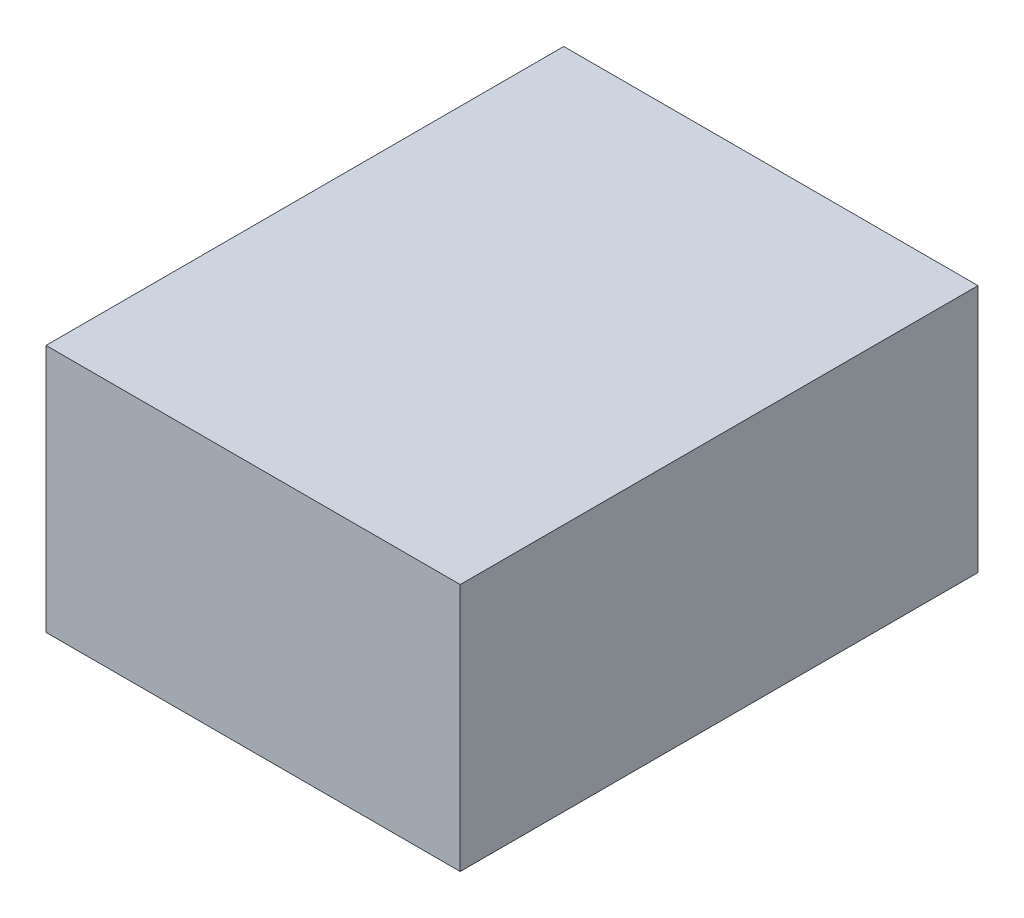
ISO-10303-21;
HEADER;
FILE_DESCRIPTION(('STEP AP214'),'2;1');
FILE_NAME('part.step','',(''),(''),'','','');
FILE_SCHEMA(('AUTOMOTIVE_DESIGN { 1 0 10303 214 1 1 1 1 }'));
ENDSEC;
DATA;
#1=APPLICATION_CONTEXT('core data for automotive mechanical design processes');
#2=APPLICATION_PROTOCOL_DEFINITION('international standard','automotive_design',2000,#1);
#3=PRODUCT_CONTEXT('',#1,'mechanical');
#4=PRODUCT('Part','Part','',(#3));
#5=PRODUCT_RELATED_PRODUCT_CATEGORY('part','',(#4));
#6=PRODUCT_DEFINITION_FORMATION('','',#4);
#7=PRODUCT_DEFINITION_CONTEXT('part definition',#1,'design');
#8=PRODUCT_DEFINITION('design','',#6,#7);
#9=PRODUCT_DEFINITION_SHAPE('','',#8);
#10=(LENGTH_UNIT() NAMED_UNIT(*) SI_UNIT(.MILLI.,.METRE.));
#11=(NAMED_UNIT(*) PLANE_ANGLE_UNIT() SI_UNIT($,.RADIAN.));
#12=(NAMED_UNIT(*) SI_UNIT($,.STERADIAN.) SOLID_ANGLE_UNIT());
#13=UNCERTAINTY_MEASURE_WITH_UNIT(LENGTH_MEASURE(1.E-05),#10,'distance_accuracy_value','');
#14=(GEOMETRIC_REPRESENTATION_CONTEXT(3) GLOBAL_UNCERTAINTY_ASSIGNED_CONTEXT((#13)) GLOBAL_UNIT_ASSIGNED_CONTEXT((#10,
#11,#12)) REPRESENTATION_CONTEXT('',''));
#15=CARTESIAN_POINT('',(0.,0.,0.));
#16=DIRECTION('',(0.,0.,1.));
#17=DIRECTION('',(1.,0.,0.));
#18=AXIS2_PLACEMENT_3D('',#15,#16,#17);
#19=CARTESIAN_POINT('',(1.,1.2,-1.25));
#20=DIRECTION('',(-1.,0.,0.));
#21=DIRECTION('',(0.,0.,1.));
#22=AXIS2_PLACEMENT_3D('',#19,#20,#21);
#23=PLANE('',#22);
#24=DIRECTION('',(0.,0.,-1.));
#25=VECTOR('',#24,1.);
#26=CARTESIAN_POINT('',(1.,0.,-1.25));
#27=LINE('',#26,#25);
#28=CARTESIAN_POINT('',(1.,0.,1.25));
#29=VERTEX_POINT('',#28);
#30=CARTESIAN_POINT('',(1.,0.,-1.25));
#31=VERTEX_POINT('',#30);
#32=EDGE_CURVE('E102',#29,#31,#27,.T.);
#33=ORIENTED_EDGE('',*,*,#32,.T.);
#34=DIRECTION('',(0.,-1.,0.));
#35=VECTOR('',#34,1.);
#36=CARTESIAN_POINT('',(1.,1.2,-1.25));
#37=LINE('',#36,#35);
#38=CARTESIAN_POINT('',(1.,1.2,-1.25));
#39=VERTEX_POINT('',#38);
#40=EDGE_CURVE('E11',#39,#31,#37,.T.);
#41=ORIENTED_EDGE('',*,*,#40,.F.);
#42=DIRECTION('',(0.,0.,-1.));
#43=VECTOR('',#42,1.);
#44=CARTESIAN_POINT('',(1.,1.2,-1.25));
#45=LINE('',#44,#43);
#46=CARTESIAN_POINT('',(1.,1.2,1.25));
#47=VERTEX_POINT('',#46);
#48=EDGE_CURVE('E90',#47,#39,#45,.T.);
#49=ORIENTED_EDGE('',*,*,#48,.F.);
#50=DIRECTION('',(0.,-1.,0.));
#51=VECTOR('',#50,1.);
#52=CARTESIAN_POINT('',(1.,1.2,1.25));
#53=LINE('',#52,#51);
#54=EDGE_CURVE('E98',#47,#29,#53,.T.);
#55=ORIENTED_EDGE('',*,*,#54,.T.);
#56=EDGE_LOOP('',(#33,#41,#49,#55));
#57=FACE_BOUND('',#56,.T.);
#58=ADVANCED_FACE('F39',(#57),#23,.F.);
#59=CARTESIAN_POINT('',(-1.,1.2,-1.25));
#60=DIRECTION('',(0.,0.,1.));
#61=DIRECTION('',(1.,0.,0.));
#62=AXIS2_PLACEMENT_3D('',#59,#60,#61);
#63=PLANE('',#62);
#64=DIRECTION('',(-1.,0.,0.));
#65=VECTOR('',#64,1.);
#66=CARTESIAN_POINT('',(-1.,0.,-1.25));
#67=LINE('',#66,#65);
#68=CARTESIAN_POINT('',(-1.,0.,-1.25));
#69=VERTEX_POINT('',#68);
#70=EDGE_CURVE('E94',#31,#69,#67,.T.);
#71=ORIENTED_EDGE('',*,*,#70,.T.);
#72=DIRECTION('',(0.,-1.,0.));
#73=VECTOR('',#72,1.);
#74=CARTESIAN_POINT('',(-1.,1.2,-1.25));
#75=LINE('',#74,#73);
#76=CARTESIAN_POINT('',(-1.,1.2,-1.25));
#77=VERTEX_POINT('',#76);
#78=EDGE_CURVE('E47',#77,#69,#75,.T.);
#79=ORIENTED_EDGE('',*,*,#78,.F.);
#80=DIRECTION('',(-1.,0.,0.));
#81=VECTOR('',#80,1.);
#82=CARTESIAN_POINT('',(-1.,1.2,-1.25));
#83=LINE('',#82,#81);
#84=EDGE_CURVE('E85',#39,#77,#83,.T.);
#85=ORIENTED_EDGE('',*,*,#84,.F.);
#86=ORIENTED_EDGE('',*,*,#40,.T.);
#87=EDGE_LOOP('',(#71,#79,#85,#86));
#88=FACE_BOUND('',#87,.T.);
#89=ADVANCED_FACE('F93',(#88),#63,.F.);
#90=CARTESIAN_POINT('',(-1.,1.2,-1.25));
#91=DIRECTION('',(1.,0.,0.));
#92=DIRECTION('',(0.,0.,-1.));
#93=AXIS2_PLACEMENT_3D('',#90,#91,#92);
#94=PLANE('',#93);
#95=DIRECTION('',(0.,0.,1.));
#96=VECTOR('',#95,1.);
#97=CARTESIAN_POINT('',(-1.,0.,-1.25));
#98=LINE('',#97,#96);
#99=CARTESIAN_POINT('',(-1.,0.,1.25));
#100=VERTEX_POINT('',#99);
#101=EDGE_CURVE('E72',#69,#100,#98,.T.);
#102=ORIENTED_EDGE('',*,*,#101,.T.);
#103=DIRECTION('',(0.,-1.,0.));
#104=VECTOR('',#103,1.);
#105=CARTESIAN_POINT('',(-1.,1.2,1.25));
#106=LINE('',#105,#104);
#107=CARTESIAN_POINT('',(-1.,1.2,1.25));
#108=VERTEX_POINT('',#107);
#109=EDGE_CURVE('E95',#108,#100,#106,.T.);
#110=ORIENTED_EDGE('',*,*,#109,.F.);
#111=DIRECTION('',(0.,0.,1.));
#112=VECTOR('',#111,1.);
#113=CARTESIAN_POINT('',(-1.,1.2,-1.25));
#114=LINE('',#113,#112);
#115=EDGE_CURVE('E88',#77,#108,#114,.T.);
#116=ORIENTED_EDGE('',*,*,#115,.F.);
#117=ORIENTED_EDGE('',*,*,#78,.T.);
#118=EDGE_LOOP('',(#102,#110,#116,#117));
#119=FACE_BOUND('',#118,.T.);
#120=ADVANCED_FACE('F96',(#119),#94,.F.);
#121=CARTESIAN_POINT('',(-1.,1.2,1.25));
#122=DIRECTION('',(0.,0.,-1.));
#123=DIRECTION('',(-1.,0.,0.));
#124=AXIS2_PLACEMENT_3D('',#121,#122,#123);
#125=PLANE('',#124);
#126=DIRECTION('',(1.,0.,0.));
#127=VECTOR('',#126,1.);
#128=CARTESIAN_POINT('',(-1.,0.,1.25));
#129=LINE('',#128,#127);
#130=EDGE_CURVE('E78',#100,#29,#129,.T.);
#131=ORIENTED_EDGE('',*,*,#130,.T.);
#132=ORIENTED_EDGE('',*,*,#54,.F.);
#133=DIRECTION('',(1.,0.,0.));
#134=VECTOR('',#133,1.);
#135=CARTESIAN_POINT('',(-1.,1.2,1.25));
#136=LINE('',#135,#134);
#137=EDGE_CURVE('E55',#108,#47,#136,.T.);
#138=ORIENTED_EDGE('',*,*,#137,.F.);
#139=ORIENTED_EDGE('',*,*,#109,.T.);
#140=EDGE_LOOP('',(#131,#132,#138,#139));
#141=FACE_BOUND('',#140,.T.);
#142=ADVANCED_FACE('F109',(#141),#125,.F.);
#143=CARTESIAN_POINT('',(0.,1.2,0.));
#144=DIRECTION('',(0.,1.,0.));
#145=DIRECTION('',(0.,0.,1.));
#146=AXIS2_PLACEMENT_3D('',#143,#144,#145);
#147=PLANE('',#146);
#148=ORIENTED_EDGE('',*,*,#48,.T.);
#149=ORIENTED_EDGE('',*,*,#84,.T.);
#150=ORIENTED_EDGE('',*,*,#115,.T.);
#151=ORIENTED_EDGE('',*,*,#137,.T.);
#152=EDGE_LOOP('',(#148,#149,#150,#151));
#153=FACE_BOUND('',#152,.T.);
#154=ADVANCED_FACE('F86',(#153),#147,.T.);
#155=CARTESIAN_POINT('',(0.,0.,0.));
#156=DIRECTION('',(0.,1.,0.));
#157=DIRECTION('',(0.,0.,1.));
#158=AXIS2_PLACEMENT_3D('',#155,#156,#157);
#159=PLANE('',#158);
#160=ORIENTED_EDGE('',*,*,#32,.F.);
#161=ORIENTED_EDGE('',*,*,#130,.F.);
#162=ORIENTED_EDGE('',*,*,#101,.F.);
#163=ORIENTED_EDGE('',*,*,#70,.F.);
#164=EDGE_LOOP('',(#160,#161,#162,#163));
#165=FACE_BOUND('',#164,.T.);
#166=ADVANCED_FACE('F112',(#165),#159,.F.);
#167=CLOSED_SHELL('',(#58,#89,#120,#142,#154,#166));
#168=MANIFOLD_SOLID_BREP('B2',#167);
#169=ADVANCED_BREP_SHAPE_REPRESENTATION('',(#18,#168),#14);
#170=SHAPE_DEFINITION_REPRESENTATION(#9,#169);
ENDSEC;
END-ISO-10303-21;
